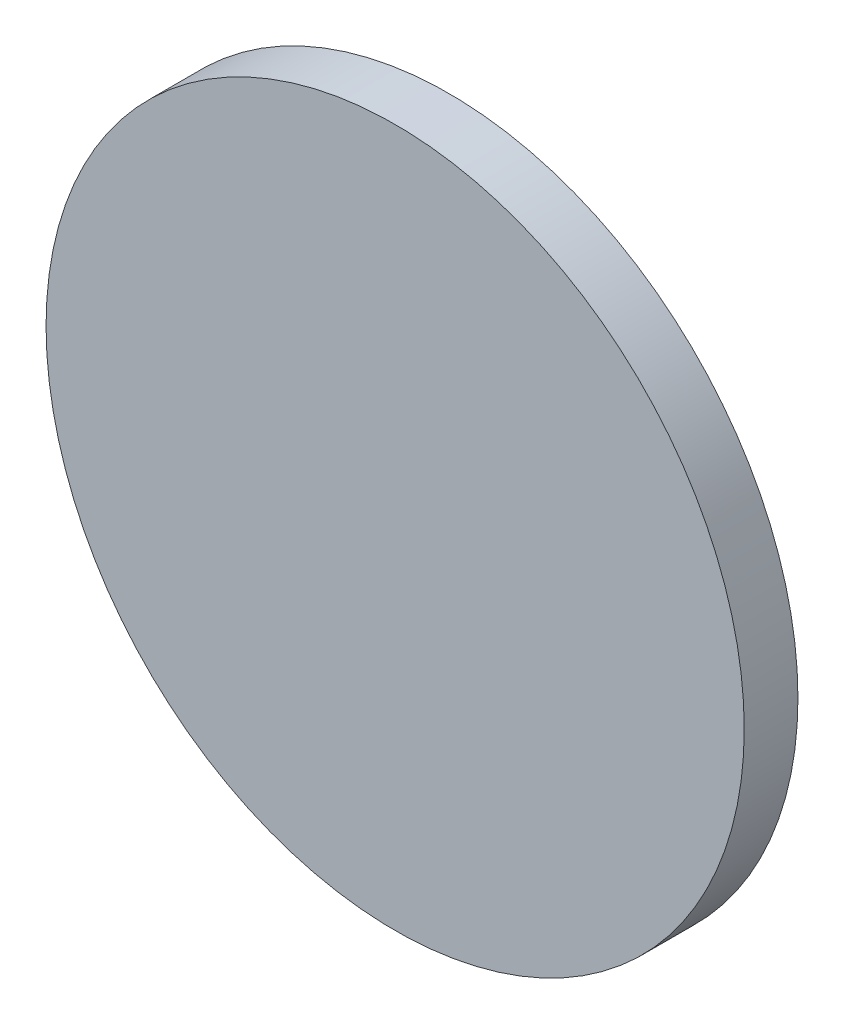
ISO-10303-21;
HEADER;
FILE_DESCRIPTION(('STEP AP214'),'2;1');
FILE_NAME('part.step','',(''),(''),'','','');
FILE_SCHEMA(('AUTOMOTIVE_DESIGN { 1 0 10303 214 1 1 1 1 }'));
ENDSEC;
DATA;
#1=APPLICATION_CONTEXT('core data for automotive mechanical design processes');
#2=APPLICATION_PROTOCOL_DEFINITION('international standard','automotive_design',2000,#1);
#3=PRODUCT_CONTEXT('',#1,'mechanical');
#4=PRODUCT('Part','Part','',(#3));
#5=PRODUCT_RELATED_PRODUCT_CATEGORY('part','',(#4));
#6=PRODUCT_DEFINITION_FORMATION('','',#4);
#7=PRODUCT_DEFINITION_CONTEXT('part definition',#1,'design');
#8=PRODUCT_DEFINITION('design','',#6,#7);
#9=PRODUCT_DEFINITION_SHAPE('','',#8);
#10=(LENGTH_UNIT() NAMED_UNIT(*) SI_UNIT(.MILLI.,.METRE.));
#11=(NAMED_UNIT(*) PLANE_ANGLE_UNIT() SI_UNIT($,.RADIAN.));
#12=(NAMED_UNIT(*) SI_UNIT($,.STERADIAN.) SOLID_ANGLE_UNIT());
#13=UNCERTAINTY_MEASURE_WITH_UNIT(LENGTH_MEASURE(1.E-05),#10,'distance_accuracy_value','');
#14=(GEOMETRIC_REPRESENTATION_CONTEXT(3) GLOBAL_UNCERTAINTY_ASSIGNED_CONTEXT((#13)) GLOBAL_UNIT_ASSIGNED_CONTEXT((#10,
#11,#12)) REPRESENTATION_CONTEXT('',''));
#15=CARTESIAN_POINT('',(0.,0.,0.));
#16=DIRECTION('',(0.,0.,1.));
#17=DIRECTION('',(1.,0.,0.));
#18=AXIS2_PLACEMENT_3D('',#15,#16,#17);
#19=CARTESIAN_POINT('',(0.,0.,50.8));
#20=DIRECTION('',(0.,0.,-1.));
#21=DIRECTION('',(-1.,0.,0.));
#22=AXIS2_PLACEMENT_3D('',#19,#20,#21);
#23=CYLINDRICAL_SURFACE('',#22,330.2);
#24=CARTESIAN_POINT('',(0.,0.,50.8));
#25=DIRECTION('',(0.,0.,1.));
#26=DIRECTION('',(1.,0.,0.));
#27=AXIS2_PLACEMENT_3D('',#24,#25,#26);
#28=CIRCLE('',#27,330.2);
#29=CARTESIAN_POINT('',(330.2,0.,50.8));
#30=VERTEX_POINT('',#29);
#31=EDGE_CURVE('E10',#30,#30,#28,.T.);
#32=ORIENTED_EDGE('',*,*,#31,.F.);
#33=EDGE_LOOP('',(#32));
#34=FACE_BOUND('',#33,.T.);
#35=CARTESIAN_POINT('',(0.,0.,0.));
#36=DIRECTION('',(0.,0.,1.));
#37=DIRECTION('',(1.,0.,0.));
#38=AXIS2_PLACEMENT_3D('',#35,#36,#37);
#39=CIRCLE('',#38,330.2);
#40=CARTESIAN_POINT('',(330.2,0.,0.));
#41=VERTEX_POINT('',#40);
#42=EDGE_CURVE('E46',#41,#41,#39,.T.);
#43=ORIENTED_EDGE('',*,*,#42,.T.);
#44=EDGE_LOOP('',(#43));
#45=FACE_BOUND('',#44,.T.);
#46=ADVANCED_FACE('F43',(#34,#45),#23,.T.);
#47=CARTESIAN_POINT('',(0.,0.,50.8));
#48=DIRECTION('',(0.,0.,1.));
#49=DIRECTION('',(1.,0.,0.));
#50=AXIS2_PLACEMENT_3D('',#47,#48,#49);
#51=PLANE('',#50);
#52=ORIENTED_EDGE('',*,*,#31,.T.);
#53=EDGE_LOOP('',(#52));
#54=FACE_BOUND('',#53,.T.);
#55=ADVANCED_FACE('F60',(#54),#51,.T.);
#56=CARTESIAN_POINT('',(0.,0.,0.));
#57=DIRECTION('',(0.,0.,1.));
#58=DIRECTION('',(1.,0.,0.));
#59=AXIS2_PLACEMENT_3D('',#56,#57,#58);
#60=PLANE('',#59);
#61=ORIENTED_EDGE('',*,*,#42,.F.);
#62=EDGE_LOOP('',(#61));
#63=FACE_BOUND('',#62,.T.);
#64=ADVANCED_FACE('F58',(#63),#60,.F.);
#65=CLOSED_SHELL('',(#46,#55,#64));
#66=MANIFOLD_SOLID_BREP('B2',#65);
#67=ADVANCED_BREP_SHAPE_REPRESENTATION('',(#18,#66),#14);
#68=SHAPE_DEFINITION_REPRESENTATION(#9,#67);
ENDSEC;
END-ISO-10303-21;
